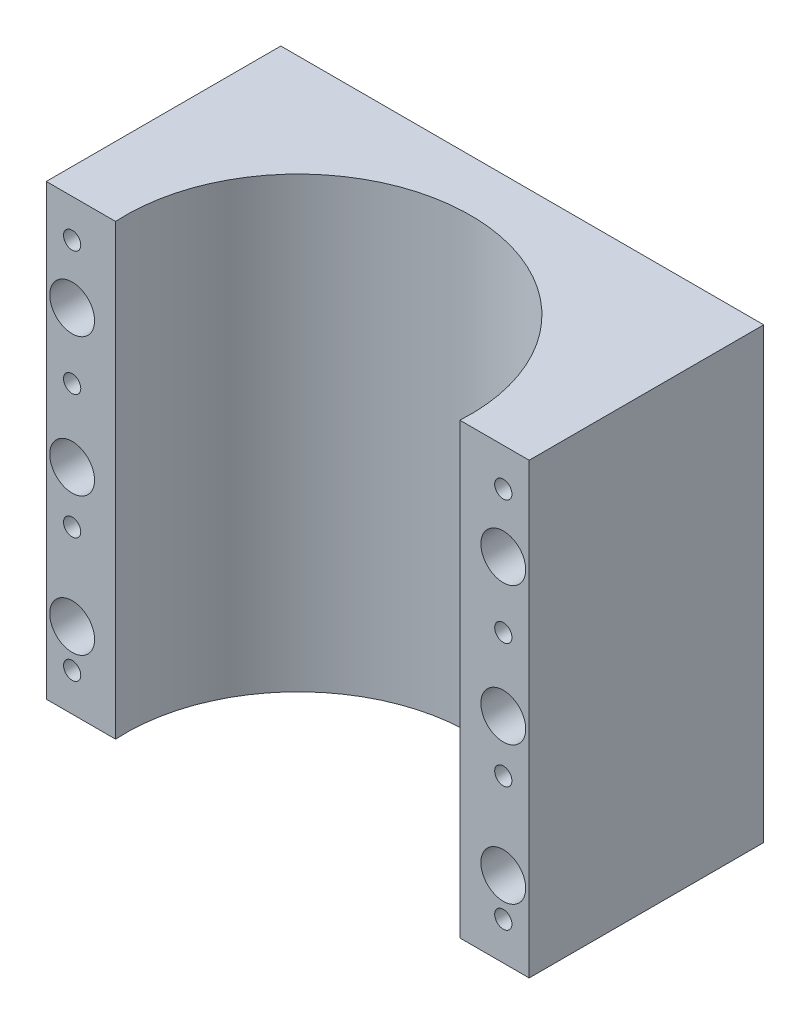
ISO-10303-21;
HEADER;
FILE_DESCRIPTION(('STEP AP214'),'2;1');
FILE_NAME('part.step','',(''),(''),'','','');
FILE_SCHEMA(('AUTOMOTIVE_DESIGN { 1 0 10303 214 1 1 1 1 }'));
ENDSEC;
DATA;
#1=APPLICATION_CONTEXT('core data for automotive mechanical design processes');
#2=APPLICATION_PROTOCOL_DEFINITION('international standard','automotive_design',2000,#1);
#3=PRODUCT_CONTEXT('',#1,'mechanical');
#4=PRODUCT('Part','Part','',(#3));
#5=PRODUCT_RELATED_PRODUCT_CATEGORY('part','',(#4));
#6=PRODUCT_DEFINITION_FORMATION('','',#4);
#7=PRODUCT_DEFINITION_CONTEXT('part definition',#1,'design');
#8=PRODUCT_DEFINITION('design','',#6,#7);
#9=PRODUCT_DEFINITION_SHAPE('','',#8);
#10=(LENGTH_UNIT() NAMED_UNIT(*) SI_UNIT(.MILLI.,.METRE.));
#11=(NAMED_UNIT(*) PLANE_ANGLE_UNIT() SI_UNIT($,.RADIAN.));
#12=(NAMED_UNIT(*) SI_UNIT($,.STERADIAN.) SOLID_ANGLE_UNIT());
#13=UNCERTAINTY_MEASURE_WITH_UNIT(LENGTH_MEASURE(1.E-05),#10,'distance_accuracy_value','');
#14=(GEOMETRIC_REPRESENTATION_CONTEXT(3) GLOBAL_UNCERTAINTY_ASSIGNED_CONTEXT((#13)) GLOBAL_UNIT_ASSIGNED_CONTEXT((#10,
#11,#12)) REPRESENTATION_CONTEXT('',''));
#15=CARTESIAN_POINT('',(0.,0.,0.));
#16=DIRECTION('',(0.,0.,1.));
#17=DIRECTION('',(1.,0.,0.));
#18=AXIS2_PLACEMENT_3D('',#15,#16,#17);
#19=CARTESIAN_POINT('',(0.,0.,68.));
#20=DIRECTION('',(0.,0.,1.));
#21=DIRECTION('',(1.,0.,0.));
#22=AXIS2_PLACEMENT_3D('',#19,#20,#21);
#23=PLANE('',#22);
#24=CARTESIAN_POINT('',(132.500000000001,-83.,68.));
#25=DIRECTION('',(0.,0.,1.));
#26=DIRECTION('',(1.,0.,0.));
#27=AXIS2_PLACEMENT_3D('',#24,#25,#26);
#28=CIRCLE('',#27,2.5);
#29=CARTESIAN_POINT('',(135.000000000001,-83.,68.));
#30=VERTEX_POINT('',#29);
#31=EDGE_CURVE('E151',#30,#30,#28,.T.);
#32=ORIENTED_EDGE('',*,*,#31,.F.);
#33=EDGE_LOOP('',(#32));
#34=FACE_BOUND('',#33,.T.);
#35=CARTESIAN_POINT('',(132.5,-47.,68.));
#36=DIRECTION('',(0.,0.,1.));
#37=DIRECTION('',(1.,0.,0.));
#38=AXIS2_PLACEMENT_3D('',#35,#36,#37);
#39=CIRCLE('',#38,2.5);
#40=CARTESIAN_POINT('',(135.,-47.,68.));
#41=VERTEX_POINT('',#40);
#42=EDGE_CURVE('E157',#41,#41,#39,.T.);
#43=ORIENTED_EDGE('',*,*,#42,.F.);
#44=EDGE_LOOP('',(#43));
#45=FACE_BOUND('',#44,.T.);
#46=CARTESIAN_POINT('',(132.5,-11.,68.));
#47=DIRECTION('',(0.,0.,1.));
#48=DIRECTION('',(1.,0.,0.));
#49=AXIS2_PLACEMENT_3D('',#46,#47,#48);
#50=CIRCLE('',#49,2.5);
#51=CARTESIAN_POINT('',(135.,-11.,68.));
#52=VERTEX_POINT('',#51);
#53=EDGE_CURVE('E163',#52,#52,#50,.T.);
#54=ORIENTED_EDGE('',*,*,#53,.F.);
#55=EDGE_LOOP('',(#54));
#56=FACE_BOUND('',#55,.T.);
#57=CARTESIAN_POINT('',(132.500000000001,-119.,68.));
#58=DIRECTION('',(0.,0.,1.));
#59=DIRECTION('',(1.,0.,0.));
#60=AXIS2_PLACEMENT_3D('',#57,#58,#59);
#61=CIRCLE('',#60,2.5);
#62=CARTESIAN_POINT('',(135.000000000001,-119.,68.));
#63=VERTEX_POINT('',#62);
#64=EDGE_CURVE('E175',#63,#63,#61,.T.);
#65=ORIENTED_EDGE('',*,*,#64,.F.);
#66=EDGE_LOOP('',(#65));
#67=FACE_BOUND('',#66,.T.);
#68=CARTESIAN_POINT('',(132.500000000001,-108.,68.));
#69=DIRECTION('',(0.,0.,1.));
#70=DIRECTION('',(1.,0.,0.));
#71=AXIS2_PLACEMENT_3D('',#68,#69,#70);
#72=CIRCLE('',#71,6.49999999999998);
#73=CARTESIAN_POINT('',(139.000000000001,-108.,68.));
#74=VERTEX_POINT('',#73);
#75=EDGE_CURVE('E228',#74,#74,#72,.T.);
#76=ORIENTED_EDGE('',*,*,#75,.F.);
#77=EDGE_LOOP('',(#76));
#78=FACE_BOUND('',#77,.T.);
#79=CARTESIAN_POINT('',(132.5,-68.,68.));
#80=DIRECTION('',(0.,0.,1.));
#81=DIRECTION('',(1.,0.,0.));
#82=AXIS2_PLACEMENT_3D('',#79,#80,#81);
#83=CIRCLE('',#82,6.49999999999998);
#84=CARTESIAN_POINT('',(139.,-68.,68.));
#85=VERTEX_POINT('',#84);
#86=EDGE_CURVE('E227',#85,#85,#83,.T.);
#87=ORIENTED_EDGE('',*,*,#86,.F.);
#88=EDGE_LOOP('',(#87));
#89=FACE_BOUND('',#88,.T.);
#90=CARTESIAN_POINT('',(132.5,-28.,68.));
#91=DIRECTION('',(0.,0.,1.));
#92=DIRECTION('',(1.,0.,0.));
#93=AXIS2_PLACEMENT_3D('',#90,#91,#92);
#94=CIRCLE('',#93,6.49999999999999);
#95=CARTESIAN_POINT('',(139.,-28.,68.));
#96=VERTEX_POINT('',#95);
#97=EDGE_CURVE('E240',#96,#96,#94,.T.);
#98=ORIENTED_EDGE('',*,*,#97,.F.);
#99=EDGE_LOOP('',(#98));
#100=FACE_BOUND('',#99,.T.);
#101=DIRECTION('',(0.,1.,0.));
#102=VECTOR('',#101,1.);
#103=CARTESIAN_POINT('',(119.909918853871,-130.,68.));
#104=LINE('',#103,#102);
#105=CARTESIAN_POINT('',(119.909918853871,-130.,68.));
#106=VERTEX_POINT('',#105);
#107=CARTESIAN_POINT('',(119.909918853871,0.,68.));
#108=VERTEX_POINT('',#107);
#109=EDGE_CURVE('E11',#106,#108,#104,.T.);
#110=ORIENTED_EDGE('',*,*,#109,.F.);
#111=DIRECTION('',(1.,0.,0.));
#112=VECTOR('',#111,1.);
#113=CARTESIAN_POINT('',(0.,-130.,68.));
#114=LINE('',#113,#112);
#115=CARTESIAN_POINT('',(140.,-130.,68.));
#116=VERTEX_POINT('',#115);
#117=EDGE_CURVE('E259',#106,#116,#114,.T.);
#118=ORIENTED_EDGE('',*,*,#117,.T.);
#119=DIRECTION('',(0.,1.,0.));
#120=VECTOR('',#119,1.);
#121=CARTESIAN_POINT('',(140.,0.,68.));
#122=LINE('',#121,#120);
#123=CARTESIAN_POINT('',(140.,0.,68.));
#124=VERTEX_POINT('',#123);
#125=EDGE_CURVE('E261',#116,#124,#122,.T.);
#126=ORIENTED_EDGE('',*,*,#125,.T.);
#127=DIRECTION('',(-1.,0.,0.));
#128=VECTOR('',#127,1.);
#129=CARTESIAN_POINT('',(0.,0.,68.));
#130=LINE('',#129,#128);
#131=EDGE_CURVE('E263',#124,#108,#130,.T.);
#132=ORIENTED_EDGE('',*,*,#131,.T.);
#133=EDGE_LOOP('',(#110,#118,#126,#132));
#134=FACE_BOUND('',#133,.T.);
#135=ADVANCED_FACE('F39',(#34,#45,#56,#67,#78,#89,#100,#134),#23,.T.);
#136=CARTESIAN_POINT('',(0.,0.,68.));
#137=DIRECTION('',(1.,0.,0.));
#138=DIRECTION('',(0.,1.,0.));
#139=AXIS2_PLACEMENT_3D('',#136,#137,#138);
#140=PLANE('',#139);
#141=DIRECTION('',(0.,-1.,0.));
#142=VECTOR('',#141,1.);
#143=CARTESIAN_POINT('',(0.,0.,0.));
#144=LINE('',#143,#142);
#145=CARTESIAN_POINT('',(0.,0.,0.));
#146=VERTEX_POINT('',#145);
#147=CARTESIAN_POINT('',(0.,-130.,0.));
#148=VERTEX_POINT('',#147);
#149=EDGE_CURVE('E255',#146,#148,#144,.T.);
#150=ORIENTED_EDGE('',*,*,#149,.T.);
#151=DIRECTION('',(0.,0.,-1.));
#152=VECTOR('',#151,1.);
#153=CARTESIAN_POINT('',(0.,-130.,68.));
#154=LINE('',#153,#152);
#155=CARTESIAN_POINT('',(0.,-130.,68.));
#156=VERTEX_POINT('',#155);
#157=EDGE_CURVE('E280',#156,#148,#154,.T.);
#158=ORIENTED_EDGE('',*,*,#157,.F.);
#159=DIRECTION('',(0.,-1.,0.));
#160=VECTOR('',#159,1.);
#161=CARTESIAN_POINT('',(0.,0.,68.));
#162=LINE('',#161,#160);
#163=CARTESIAN_POINT('',(0.,0.,68.));
#164=VERTEX_POINT('',#163);
#165=EDGE_CURVE('E257',#164,#156,#162,.T.);
#166=ORIENTED_EDGE('',*,*,#165,.F.);
#167=DIRECTION('',(0.,0.,-1.));
#168=VECTOR('',#167,1.);
#169=CARTESIAN_POINT('',(0.,0.,68.));
#170=LINE('',#169,#168);
#171=EDGE_CURVE('E266',#164,#146,#170,.T.);
#172=ORIENTED_EDGE('',*,*,#171,.T.);
#173=EDGE_LOOP('',(#150,#158,#166,#172));
#174=FACE_BOUND('',#173,.T.);
#175=ADVANCED_FACE('F41',(#174),#140,.F.);
#176=CARTESIAN_POINT('',(0.,-130.,68.));
#177=DIRECTION('',(0.,1.,0.));
#178=DIRECTION('',(0.,0.,1.));
#179=AXIS2_PLACEMENT_3D('',#176,#177,#178);
#180=PLANE('',#179);
#181=ORIENTED_EDGE('',*,*,#117,.F.);
#182=CARTESIAN_POINT('',(70.,-130.,65.));
#183=DIRECTION('',(0.,1.,0.));
#184=DIRECTION('',(0.,0.,1.));
#185=AXIS2_PLACEMENT_3D('',#182,#183,#184);
#186=CIRCLE('',#185,50.);
#187=CARTESIAN_POINT('',(20.0900811461289,-130.,68.));
#188=VERTEX_POINT('',#187);
#189=EDGE_CURVE('E253',#106,#188,#186,.T.);
#190=ORIENTED_EDGE('',*,*,#189,.T.);
#191=EDGE_CURVE('E91',#156,#188,#114,.T.);
#192=ORIENTED_EDGE('',*,*,#191,.F.);
#193=ORIENTED_EDGE('',*,*,#157,.T.);
#194=DIRECTION('',(1.,0.,0.));
#195=VECTOR('',#194,1.);
#196=CARTESIAN_POINT('',(0.,-130.,0.));
#197=LINE('',#196,#195);
#198=CARTESIAN_POINT('',(140.,-130.,0.));
#199=VERTEX_POINT('',#198);
#200=EDGE_CURVE('E269',#148,#199,#197,.T.);
#201=ORIENTED_EDGE('',*,*,#200,.T.);
#202=DIRECTION('',(0.,0.,-1.));
#203=VECTOR('',#202,1.);
#204=CARTESIAN_POINT('',(140.,-130.,68.));
#205=LINE('',#204,#203);
#206=EDGE_CURVE('E277',#116,#199,#205,.T.);
#207=ORIENTED_EDGE('',*,*,#206,.F.);
#208=EDGE_LOOP('',(#181,#190,#192,#193,#201,#207));
#209=FACE_BOUND('',#208,.T.);
#210=ADVANCED_FACE('F284',(#209),#180,.F.);
#211=CARTESIAN_POINT('',(140.,0.,68.));
#212=DIRECTION('',(-1.,0.,0.));
#213=DIRECTION('',(0.,-1.,0.));
#214=AXIS2_PLACEMENT_3D('',#211,#212,#213);
#215=PLANE('',#214);
#216=DIRECTION('',(0.,1.,0.));
#217=VECTOR('',#216,1.);
#218=CARTESIAN_POINT('',(140.,0.,0.));
#219=LINE('',#218,#217);
#220=CARTESIAN_POINT('',(140.,0.,0.));
#221=VERTEX_POINT('',#220);
#222=EDGE_CURVE('E271',#199,#221,#219,.T.);
#223=ORIENTED_EDGE('',*,*,#222,.T.);
#224=DIRECTION('',(0.,0.,-1.));
#225=VECTOR('',#224,1.);
#226=CARTESIAN_POINT('',(140.,0.,68.));
#227=LINE('',#226,#225);
#228=EDGE_CURVE('E275',#124,#221,#227,.T.);
#229=ORIENTED_EDGE('',*,*,#228,.F.);
#230=ORIENTED_EDGE('',*,*,#125,.F.);
#231=ORIENTED_EDGE('',*,*,#206,.T.);
#232=EDGE_LOOP('',(#223,#229,#230,#231));
#233=FACE_BOUND('',#232,.T.);
#234=ADVANCED_FACE('F295',(#233),#215,.F.);
#235=CARTESIAN_POINT('',(0.,0.,68.));
#236=DIRECTION('',(0.,-1.,0.));
#237=DIRECTION('',(0.,0.,-1.));
#238=AXIS2_PLACEMENT_3D('',#235,#236,#237);
#239=PLANE('',#238);
#240=CARTESIAN_POINT('',(20.0900811461289,0.,68.));
#241=VERTEX_POINT('',#240);
#242=EDGE_CURVE('E61',#241,#164,#130,.T.);
#243=ORIENTED_EDGE('',*,*,#242,.F.);
#244=CARTESIAN_POINT('',(70.,0.,65.));
#245=DIRECTION('',(0.,1.,0.));
#246=DIRECTION('',(0.,0.,1.));
#247=AXIS2_PLACEMENT_3D('',#244,#245,#246);
#248=CIRCLE('',#247,50.);
#249=EDGE_CURVE('E53',#108,#241,#248,.T.);
#250=ORIENTED_EDGE('',*,*,#249,.F.);
#251=ORIENTED_EDGE('',*,*,#131,.F.);
#252=ORIENTED_EDGE('',*,*,#228,.T.);
#253=DIRECTION('',(-1.,0.,0.));
#254=VECTOR('',#253,1.);
#255=CARTESIAN_POINT('',(0.,0.,0.));
#256=LINE('',#255,#254);
#257=EDGE_CURVE('E83',#221,#146,#256,.T.);
#258=ORIENTED_EDGE('',*,*,#257,.T.);
#259=ORIENTED_EDGE('',*,*,#171,.F.);
#260=EDGE_LOOP('',(#243,#250,#251,#252,#258,#259));
#261=FACE_BOUND('',#260,.T.);
#262=ADVANCED_FACE('F307',(#261),#239,.F.);
#263=CARTESIAN_POINT('',(7.50000000000002,-11.,68.));
#264=DIRECTION('',(0.,0.,1.));
#265=DIRECTION('',(1.,0.,0.));
#266=AXIS2_PLACEMENT_3D('',#263,#264,#265);
#267=CIRCLE('',#266,2.49999999999999);
#268=CARTESIAN_POINT('',(10.,-11.,68.));
#269=VERTEX_POINT('',#268);
#270=EDGE_CURVE('E135',#269,#269,#267,.T.);
#271=ORIENTED_EDGE('',*,*,#270,.F.);
#272=EDGE_LOOP('',(#271));
#273=FACE_BOUND('',#272,.T.);
#274=CARTESIAN_POINT('',(7.50000000000039,-47.,68.));
#275=DIRECTION('',(0.,0.,1.));
#276=DIRECTION('',(1.,0.,0.));
#277=AXIS2_PLACEMENT_3D('',#274,#275,#276);
#278=CIRCLE('',#277,2.49999999999999);
#279=CARTESIAN_POINT('',(10.0000000000004,-47.,68.));
#280=VERTEX_POINT('',#279);
#281=EDGE_CURVE('E134',#280,#280,#278,.T.);
#282=ORIENTED_EDGE('',*,*,#281,.F.);
#283=EDGE_LOOP('',(#282));
#284=FACE_BOUND('',#283,.T.);
#285=CARTESIAN_POINT('',(7.50000000000076,-83.,68.));
#286=DIRECTION('',(0.,0.,1.));
#287=DIRECTION('',(1.,0.,0.));
#288=AXIS2_PLACEMENT_3D('',#285,#286,#287);
#289=CIRCLE('',#288,2.49999999999999);
#290=CARTESIAN_POINT('',(10.0000000000008,-83.,68.));
#291=VERTEX_POINT('',#290);
#292=EDGE_CURVE('E145',#291,#291,#289,.T.);
#293=ORIENTED_EDGE('',*,*,#292,.F.);
#294=EDGE_LOOP('',(#293));
#295=FACE_BOUND('',#294,.T.);
#296=CARTESIAN_POINT('',(7.50000000000114,-119.,68.));
#297=DIRECTION('',(0.,0.,1.));
#298=DIRECTION('',(1.,0.,0.));
#299=AXIS2_PLACEMENT_3D('',#296,#297,#298);
#300=CIRCLE('',#299,2.49999999999999);
#301=CARTESIAN_POINT('',(10.0000000000011,-119.,68.));
#302=VERTEX_POINT('',#301);
#303=EDGE_CURVE('E169',#302,#302,#300,.T.);
#304=ORIENTED_EDGE('',*,*,#303,.F.);
#305=EDGE_LOOP('',(#304));
#306=FACE_BOUND('',#305,.T.);
#307=CARTESIAN_POINT('',(7.50000000000042,-68.,68.));
#308=DIRECTION('',(0.,0.,1.));
#309=DIRECTION('',(1.,0.,0.));
#310=AXIS2_PLACEMENT_3D('',#307,#308,#309);
#311=CIRCLE('',#310,6.5);
#312=CARTESIAN_POINT('',(14.0000000000004,-68.,68.));
#313=VERTEX_POINT('',#312);
#314=EDGE_CURVE('E221',#313,#313,#311,.T.);
#315=ORIENTED_EDGE('',*,*,#314,.F.);
#316=EDGE_LOOP('',(#315));
#317=FACE_BOUND('',#316,.T.);
#318=CARTESIAN_POINT('',(7.50000000000083,-108.,68.));
#319=DIRECTION('',(0.,0.,1.));
#320=DIRECTION('',(1.,0.,0.));
#321=AXIS2_PLACEMENT_3D('',#318,#319,#320);
#322=CIRCLE('',#321,6.5);
#323=CARTESIAN_POINT('',(14.0000000000008,-108.,68.));
#324=VERTEX_POINT('',#323);
#325=EDGE_CURVE('E215',#324,#324,#322,.T.);
#326=ORIENTED_EDGE('',*,*,#325,.F.);
#327=EDGE_LOOP('',(#326));
#328=FACE_BOUND('',#327,.T.);
#329=CARTESIAN_POINT('',(7.5,-28.,68.));
#330=DIRECTION('',(0.,0.,1.));
#331=DIRECTION('',(1.,0.,0.));
#332=AXIS2_PLACEMENT_3D('',#329,#330,#331);
#333=CIRCLE('',#332,6.5);
#334=CARTESIAN_POINT('',(14.,-28.,68.));
#335=VERTEX_POINT('',#334);
#336=EDGE_CURVE('E239',#335,#335,#333,.T.);
#337=ORIENTED_EDGE('',*,*,#336,.F.);
#338=EDGE_LOOP('',(#337));
#339=FACE_BOUND('',#338,.T.);
#340=DIRECTION('',(0.,1.,0.));
#341=VECTOR('',#340,1.);
#342=CARTESIAN_POINT('',(20.0900811461289,-130.,68.));
#343=LINE('',#342,#341);
#344=EDGE_CURVE('E47',#241,#188,#343,.F.);
#345=ORIENTED_EDGE('',*,*,#344,.F.);
#346=ORIENTED_EDGE('',*,*,#242,.T.);
#347=ORIENTED_EDGE('',*,*,#165,.T.);
#348=ORIENTED_EDGE('',*,*,#191,.T.);
#349=EDGE_LOOP('',(#345,#346,#347,#348));
#350=FACE_BOUND('',#349,.T.);
#351=ADVANCED_FACE('F286',(#273,#284,#295,#306,#317,#328,#339,#350),#23,.T.);
#352=CARTESIAN_POINT('',(0.,0.,0.));
#353=DIRECTION('',(0.,0.,1.));
#354=DIRECTION('',(1.,0.,0.));
#355=AXIS2_PLACEMENT_3D('',#352,#353,#354);
#356=PLANE('',#355);
#357=CARTESIAN_POINT('',(7.50000000000042,-68.,0.));
#358=DIRECTION('',(0.,0.,1.));
#359=DIRECTION('',(1.,0.,0.));
#360=AXIS2_PLACEMENT_3D('',#357,#358,#359);
#361=CIRCLE('',#360,4.);
#362=CARTESIAN_POINT('',(11.5000000000004,-68.,0.));
#363=VERTEX_POINT('',#362);
#364=EDGE_CURVE('E195',#363,#363,#361,.T.);
#365=ORIENTED_EDGE('',*,*,#364,.T.);
#366=EDGE_LOOP('',(#365));
#367=FACE_BOUND('',#366,.T.);
#368=CARTESIAN_POINT('',(132.500000000001,-108.,0.));
#369=DIRECTION('',(0.,0.,1.));
#370=DIRECTION('',(1.,0.,0.));
#371=AXIS2_PLACEMENT_3D('',#368,#369,#370);
#372=CIRCLE('',#371,3.99999999999999);
#373=CARTESIAN_POINT('',(136.500000000001,-108.,0.));
#374=VERTEX_POINT('',#373);
#375=EDGE_CURVE('E188',#374,#374,#372,.T.);
#376=ORIENTED_EDGE('',*,*,#375,.T.);
#377=EDGE_LOOP('',(#376));
#378=FACE_BOUND('',#377,.T.);
#379=CARTESIAN_POINT('',(132.5,-68.,0.));
#380=DIRECTION('',(0.,0.,1.));
#381=DIRECTION('',(1.,0.,0.));
#382=AXIS2_PLACEMENT_3D('',#379,#380,#381);
#383=CIRCLE('',#382,3.99999999999999);
#384=CARTESIAN_POINT('',(136.5,-68.,0.));
#385=VERTEX_POINT('',#384);
#386=EDGE_CURVE('E207',#385,#385,#383,.T.);
#387=ORIENTED_EDGE('',*,*,#386,.T.);
#388=EDGE_LOOP('',(#387));
#389=FACE_BOUND('',#388,.T.);
#390=CARTESIAN_POINT('',(7.5,-28.,0.));
#391=DIRECTION('',(0.,0.,1.));
#392=DIRECTION('',(1.,0.,0.));
#393=AXIS2_PLACEMENT_3D('',#390,#391,#392);
#394=CIRCLE('',#393,4.);
#395=CARTESIAN_POINT('',(11.5,-28.,0.));
#396=VERTEX_POINT('',#395);
#397=EDGE_CURVE('E200',#396,#396,#394,.T.);
#398=ORIENTED_EDGE('',*,*,#397,.T.);
#399=EDGE_LOOP('',(#398));
#400=FACE_BOUND('',#399,.T.);
#401=CARTESIAN_POINT('',(7.50000000000083,-108.,0.));
#402=DIRECTION('',(0.,0.,1.));
#403=DIRECTION('',(1.,0.,0.));
#404=AXIS2_PLACEMENT_3D('',#401,#402,#403);
#405=CIRCLE('',#404,4.);
#406=CARTESIAN_POINT('',(11.5000000000008,-108.,0.));
#407=VERTEX_POINT('',#406);
#408=EDGE_CURVE('E182',#407,#407,#405,.T.);
#409=ORIENTED_EDGE('',*,*,#408,.T.);
#410=EDGE_LOOP('',(#409));
#411=FACE_BOUND('',#410,.T.);
#412=CARTESIAN_POINT('',(132.5,-28.,0.));
#413=DIRECTION('',(0.,0.,1.));
#414=DIRECTION('',(1.,0.,0.));
#415=AXIS2_PLACEMENT_3D('',#412,#413,#414);
#416=CIRCLE('',#415,3.99999999999999);
#417=CARTESIAN_POINT('',(136.5,-28.,0.));
#418=VERTEX_POINT('',#417);
#419=EDGE_CURVE('E212',#418,#418,#416,.T.);
#420=ORIENTED_EDGE('',*,*,#419,.T.);
#421=EDGE_LOOP('',(#420));
#422=FACE_BOUND('',#421,.T.);
#423=ORIENTED_EDGE('',*,*,#149,.F.);
#424=ORIENTED_EDGE('',*,*,#257,.F.);
#425=ORIENTED_EDGE('',*,*,#222,.F.);
#426=ORIENTED_EDGE('',*,*,#200,.F.);
#427=EDGE_LOOP('',(#423,#424,#425,#426));
#428=FACE_BOUND('',#427,.T.);
#429=ADVANCED_FACE('F297',(#367,#378,#389,#400,#411,#422,#428),#356,.F.);
#430=CARTESIAN_POINT('',(70.,-130.,65.));
#431=DIRECTION('',(0.,1.,0.));
#432=DIRECTION('',(0.,0.,1.));
#433=AXIS2_PLACEMENT_3D('',#430,#431,#432);
#434=CYLINDRICAL_SURFACE('',#433,50.);
#435=ORIENTED_EDGE('',*,*,#109,.T.);
#436=ORIENTED_EDGE('',*,*,#249,.T.);
#437=ORIENTED_EDGE('',*,*,#344,.T.);
#438=ORIENTED_EDGE('',*,*,#189,.F.);
#439=EDGE_LOOP('',(#435,#436,#437,#438));
#440=FACE_BOUND('',#439,.T.);
#441=ADVANCED_FACE('F281',(#440),#434,.F.);
#442=CARTESIAN_POINT('',(7.5,-28.,33.));
#443=DIRECTION('',(0.,0.,1.));
#444=DIRECTION('',(1.,0.,0.));
#445=AXIS2_PLACEMENT_3D('',#442,#443,#444);
#446=CYLINDRICAL_SURFACE('',#445,6.5);
#447=CARTESIAN_POINT('',(7.5,-28.,33.));
#448=DIRECTION('',(0.,0.,1.));
#449=DIRECTION('',(1.,0.,0.));
#450=AXIS2_PLACEMENT_3D('',#447,#448,#449);
#451=CIRCLE('',#450,6.5);
#452=CARTESIAN_POINT('',(14.,-28.,33.));
#453=VERTEX_POINT('',#452);
#454=EDGE_CURVE('E248',#453,#453,#451,.T.);
#455=ORIENTED_EDGE('',*,*,#454,.F.);
#456=EDGE_LOOP('',(#455));
#457=FACE_BOUND('',#456,.T.);
#458=ORIENTED_EDGE('',*,*,#336,.T.);
#459=EDGE_LOOP('',(#458));
#460=FACE_BOUND('',#459,.T.);
#461=ADVANCED_FACE('F305',(#457,#460),#446,.F.);
#462=CARTESIAN_POINT('',(7.5,-28.,33.));
#463=DIRECTION('',(0.,0.,1.));
#464=DIRECTION('',(1.,0.,0.));
#465=AXIS2_PLACEMENT_3D('',#462,#463,#464);
#466=PLANE('',#465);
#467=CARTESIAN_POINT('',(7.5,-28.,33.));
#468=DIRECTION('',(0.,0.,1.));
#469=DIRECTION('',(1.,0.,0.));
#470=AXIS2_PLACEMENT_3D('',#467,#468,#469);
#471=CIRCLE('',#470,4.);
#472=CARTESIAN_POINT('',(11.5,-28.,33.));
#473=VERTEX_POINT('',#472);
#474=EDGE_CURVE('E204',#473,#473,#471,.T.);
#475=ORIENTED_EDGE('',*,*,#474,.F.);
#476=EDGE_LOOP('',(#475));
#477=FACE_BOUND('',#476,.T.);
#478=ORIENTED_EDGE('',*,*,#454,.T.);
#479=EDGE_LOOP('',(#478));
#480=FACE_BOUND('',#479,.T.);
#481=ADVANCED_FACE('F322',(#477,#480),#466,.T.);
#482=CARTESIAN_POINT('',(7.50000000000083,-108.,33.));
#483=DIRECTION('',(0.,0.,1.));
#484=DIRECTION('',(1.,0.,0.));
#485=AXIS2_PLACEMENT_3D('',#482,#483,#484);
#486=CYLINDRICAL_SURFACE('',#485,6.5);
#487=CARTESIAN_POINT('',(7.50000000000083,-108.,33.));
#488=DIRECTION('',(0.,0.,1.));
#489=DIRECTION('',(1.,0.,0.));
#490=AXIS2_PLACEMENT_3D('',#487,#488,#489);
#491=CIRCLE('',#490,6.5);
#492=CARTESIAN_POINT('',(14.0000000000008,-108.,33.));
#493=VERTEX_POINT('',#492);
#494=EDGE_CURVE('E218',#493,#493,#491,.T.);
#495=ORIENTED_EDGE('',*,*,#494,.F.);
#496=EDGE_LOOP('',(#495));
#497=FACE_BOUND('',#496,.T.);
#498=ORIENTED_EDGE('',*,*,#325,.T.);
#499=EDGE_LOOP('',(#498));
#500=FACE_BOUND('',#499,.T.);
#501=ADVANCED_FACE('F326',(#497,#500),#486,.F.);
#502=CARTESIAN_POINT('',(7.50000000000083,-108.,33.));
#503=DIRECTION('',(0.,0.,1.));
#504=DIRECTION('',(1.,0.,0.));
#505=AXIS2_PLACEMENT_3D('',#502,#503,#504);
#506=PLANE('',#505);
#507=CARTESIAN_POINT('',(7.50000000000083,-108.,33.));
#508=DIRECTION('',(0.,0.,1.));
#509=DIRECTION('',(1.,0.,0.));
#510=AXIS2_PLACEMENT_3D('',#507,#508,#509);
#511=CIRCLE('',#510,4.);
#512=CARTESIAN_POINT('',(11.5000000000008,-108.,33.));
#513=VERTEX_POINT('',#512);
#514=EDGE_CURVE('E181',#513,#513,#511,.T.);
#515=ORIENTED_EDGE('',*,*,#514,.F.);
#516=EDGE_LOOP('',(#515));
#517=FACE_BOUND('',#516,.T.);
#518=ORIENTED_EDGE('',*,*,#494,.T.);
#519=EDGE_LOOP('',(#518));
#520=FACE_BOUND('',#519,.T.);
#521=ADVANCED_FACE('F349',(#517,#520),#506,.T.);
#522=CARTESIAN_POINT('',(7.50000000000042,-68.,33.));
#523=DIRECTION('',(0.,0.,1.));
#524=DIRECTION('',(1.,0.,0.));
#525=AXIS2_PLACEMENT_3D('',#522,#523,#524);
#526=CYLINDRICAL_SURFACE('',#525,6.5);
#527=CARTESIAN_POINT('',(7.50000000000042,-68.,33.));
#528=DIRECTION('',(0.,0.,1.));
#529=DIRECTION('',(1.,0.,0.));
#530=AXIS2_PLACEMENT_3D('',#527,#528,#529);
#531=CIRCLE('',#530,6.5);
#532=CARTESIAN_POINT('',(14.0000000000004,-68.,33.));
#533=VERTEX_POINT('',#532);
#534=EDGE_CURVE('E231',#533,#533,#531,.T.);
#535=ORIENTED_EDGE('',*,*,#534,.F.);
#536=EDGE_LOOP('',(#535));
#537=FACE_BOUND('',#536,.T.);
#538=ORIENTED_EDGE('',*,*,#314,.T.);
#539=EDGE_LOOP('',(#538));
#540=FACE_BOUND('',#539,.T.);
#541=ADVANCED_FACE('F346',(#537,#540),#526,.F.);
#542=CARTESIAN_POINT('',(7.50000000000042,-68.,33.));
#543=DIRECTION('',(0.,0.,1.));
#544=DIRECTION('',(1.,0.,0.));
#545=AXIS2_PLACEMENT_3D('',#542,#543,#544);
#546=PLANE('',#545);
#547=CARTESIAN_POINT('',(7.50000000000042,-68.,33.));
#548=DIRECTION('',(0.,0.,1.));
#549=DIRECTION('',(1.,0.,0.));
#550=AXIS2_PLACEMENT_3D('',#547,#548,#549);
#551=CIRCLE('',#550,4.);
#552=CARTESIAN_POINT('',(11.5000000000004,-68.,33.));
#553=VERTEX_POINT('',#552);
#554=EDGE_CURVE('E185',#553,#553,#551,.T.);
#555=ORIENTED_EDGE('',*,*,#554,.F.);
#556=EDGE_LOOP('',(#555));
#557=FACE_BOUND('',#556,.T.);
#558=ORIENTED_EDGE('',*,*,#534,.T.);
#559=EDGE_LOOP('',(#558));
#560=FACE_BOUND('',#559,.T.);
#561=ADVANCED_FACE('F341',(#557,#560),#546,.T.);
#562=CARTESIAN_POINT('',(132.5,-28.,33.));
#563=DIRECTION('',(0.,0.,1.));
#564=DIRECTION('',(1.,0.,0.));
#565=AXIS2_PLACEMENT_3D('',#562,#563,#564);
#566=CYLINDRICAL_SURFACE('',#565,6.49999999999999);
#567=CARTESIAN_POINT('',(132.5,-28.,33.));
#568=DIRECTION('',(0.,0.,1.));
#569=DIRECTION('',(1.,0.,0.));
#570=AXIS2_PLACEMENT_3D('',#567,#568,#569);
#571=CIRCLE('',#570,6.49999999999999);
#572=CARTESIAN_POINT('',(139.,-28.,33.));
#573=VERTEX_POINT('',#572);
#574=EDGE_CURVE('E236',#573,#573,#571,.T.);
#575=ORIENTED_EDGE('',*,*,#574,.F.);
#576=EDGE_LOOP('',(#575));
#577=FACE_BOUND('',#576,.T.);
#578=ORIENTED_EDGE('',*,*,#97,.T.);
#579=EDGE_LOOP('',(#578));
#580=FACE_BOUND('',#579,.T.);
#581=ADVANCED_FACE('F338',(#577,#580),#566,.F.);
#582=CARTESIAN_POINT('',(132.5,-28.,33.));
#583=DIRECTION('',(0.,0.,1.));
#584=DIRECTION('',(1.,0.,0.));
#585=AXIS2_PLACEMENT_3D('',#582,#583,#584);
#586=PLANE('',#585);
#587=CARTESIAN_POINT('',(132.5,-28.,33.));
#588=DIRECTION('',(0.,0.,1.));
#589=DIRECTION('',(1.,0.,0.));
#590=AXIS2_PLACEMENT_3D('',#587,#588,#589);
#591=CIRCLE('',#590,3.99999999999999);
#592=CARTESIAN_POINT('',(136.5,-28.,33.));
#593=VERTEX_POINT('',#592);
#594=EDGE_CURVE('E203',#593,#593,#591,.T.);
#595=ORIENTED_EDGE('',*,*,#594,.F.);
#596=EDGE_LOOP('',(#595));
#597=FACE_BOUND('',#596,.T.);
#598=ORIENTED_EDGE('',*,*,#574,.T.);
#599=EDGE_LOOP('',(#598));
#600=FACE_BOUND('',#599,.T.);
#601=ADVANCED_FACE('F332',(#597,#600),#586,.T.);
#602=CARTESIAN_POINT('',(132.5,-68.,33.));
#603=DIRECTION('',(0.,0.,1.));
#604=DIRECTION('',(1.,0.,0.));
#605=AXIS2_PLACEMENT_3D('',#602,#603,#604);
#606=CYLINDRICAL_SURFACE('',#605,6.49999999999998);
#607=CARTESIAN_POINT('',(132.5,-68.,33.));
#608=DIRECTION('',(0.,0.,1.));
#609=DIRECTION('',(1.,0.,0.));
#610=AXIS2_PLACEMENT_3D('',#607,#608,#609);
#611=CIRCLE('',#610,6.49999999999998);
#612=CARTESIAN_POINT('',(139.,-68.,33.));
#613=VERTEX_POINT('',#612);
#614=EDGE_CURVE('E243',#613,#613,#611,.T.);
#615=ORIENTED_EDGE('',*,*,#614,.F.);
#616=EDGE_LOOP('',(#615));
#617=FACE_BOUND('',#616,.T.);
#618=ORIENTED_EDGE('',*,*,#86,.T.);
#619=EDGE_LOOP('',(#618));
#620=FACE_BOUND('',#619,.T.);
#621=ADVANCED_FACE('F328',(#617,#620),#606,.F.);
#622=CARTESIAN_POINT('',(132.5,-68.,33.));
#623=DIRECTION('',(0.,0.,1.));
#624=DIRECTION('',(1.,0.,0.));
#625=AXIS2_PLACEMENT_3D('',#622,#623,#624);
#626=PLANE('',#625);
#627=CARTESIAN_POINT('',(132.5,-68.,33.));
#628=DIRECTION('',(0.,0.,1.));
#629=DIRECTION('',(1.,0.,0.));
#630=AXIS2_PLACEMENT_3D('',#627,#628,#629);
#631=CIRCLE('',#630,3.99999999999999);
#632=CARTESIAN_POINT('',(136.5,-68.,33.));
#633=VERTEX_POINT('',#632);
#634=EDGE_CURVE('E191',#633,#633,#631,.T.);
#635=ORIENTED_EDGE('',*,*,#634,.F.);
#636=EDGE_LOOP('',(#635));
#637=FACE_BOUND('',#636,.T.);
#638=ORIENTED_EDGE('',*,*,#614,.T.);
#639=EDGE_LOOP('',(#638));
#640=FACE_BOUND('',#639,.T.);
#641=ADVANCED_FACE('F331',(#637,#640),#626,.T.);
#642=CARTESIAN_POINT('',(132.500000000001,-108.,33.));
#643=DIRECTION('',(0.,0.,1.));
#644=DIRECTION('',(1.,0.,0.));
#645=AXIS2_PLACEMENT_3D('',#642,#643,#644);
#646=CYLINDRICAL_SURFACE('',#645,6.49999999999998);
#647=CARTESIAN_POINT('',(132.500000000001,-108.,33.));
#648=DIRECTION('',(0.,0.,1.));
#649=DIRECTION('',(1.,0.,0.));
#650=AXIS2_PLACEMENT_3D('',#647,#648,#649);
#651=CIRCLE('',#650,6.49999999999998);
#652=CARTESIAN_POINT('',(139.000000000001,-108.,33.));
#653=VERTEX_POINT('',#652);
#654=EDGE_CURVE('E224',#653,#653,#651,.T.);
#655=ORIENTED_EDGE('',*,*,#654,.F.);
#656=EDGE_LOOP('',(#655));
#657=FACE_BOUND('',#656,.T.);
#658=ORIENTED_EDGE('',*,*,#75,.T.);
#659=EDGE_LOOP('',(#658));
#660=FACE_BOUND('',#659,.T.);
#661=ADVANCED_FACE('F336',(#657,#660),#646,.F.);
#662=CARTESIAN_POINT('',(132.500000000001,-108.,33.));
#663=DIRECTION('',(0.,0.,1.));
#664=DIRECTION('',(1.,0.,0.));
#665=AXIS2_PLACEMENT_3D('',#662,#663,#664);
#666=PLANE('',#665);
#667=CARTESIAN_POINT('',(132.500000000001,-108.,33.));
#668=DIRECTION('',(0.,0.,1.));
#669=DIRECTION('',(1.,0.,0.));
#670=AXIS2_PLACEMENT_3D('',#667,#668,#669);
#671=CIRCLE('',#670,3.99999999999999);
#672=CARTESIAN_POINT('',(136.500000000001,-108.,33.));
#673=VERTEX_POINT('',#672);
#674=EDGE_CURVE('E192',#673,#673,#671,.T.);
#675=ORIENTED_EDGE('',*,*,#674,.F.);
#676=EDGE_LOOP('',(#675));
#677=FACE_BOUND('',#676,.T.);
#678=ORIENTED_EDGE('',*,*,#654,.T.);
#679=EDGE_LOOP('',(#678));
#680=FACE_BOUND('',#679,.T.);
#681=ADVANCED_FACE('F356',(#677,#680),#666,.T.);
#682=CARTESIAN_POINT('',(132.5,-28.,0.));
#683=DIRECTION('',(0.,0.,1.));
#684=DIRECTION('',(1.,0.,0.));
#685=AXIS2_PLACEMENT_3D('',#682,#683,#684);
#686=CYLINDRICAL_SURFACE('',#685,3.99999999999999);
#687=ORIENTED_EDGE('',*,*,#419,.F.);
#688=EDGE_LOOP('',(#687));
#689=FACE_BOUND('',#688,.T.);
#690=ORIENTED_EDGE('',*,*,#594,.T.);
#691=EDGE_LOOP('',(#690));
#692=FACE_BOUND('',#691,.T.);
#693=ADVANCED_FACE('F360',(#689,#692),#686,.F.);
#694=CARTESIAN_POINT('',(7.50000000000083,-108.,0.));
#695=DIRECTION('',(0.,0.,1.));
#696=DIRECTION('',(1.,0.,0.));
#697=AXIS2_PLACEMENT_3D('',#694,#695,#696);
#698=CYLINDRICAL_SURFACE('',#697,4.);
#699=ORIENTED_EDGE('',*,*,#408,.F.);
#700=EDGE_LOOP('',(#699));
#701=FACE_BOUND('',#700,.T.);
#702=ORIENTED_EDGE('',*,*,#514,.T.);
#703=EDGE_LOOP('',(#702));
#704=FACE_BOUND('',#703,.T.);
#705=ADVANCED_FACE('F370',(#701,#704),#698,.F.);
#706=CARTESIAN_POINT('',(7.5,-28.,0.));
#707=DIRECTION('',(0.,0.,1.));
#708=DIRECTION('',(1.,0.,0.));
#709=AXIS2_PLACEMENT_3D('',#706,#707,#708);
#710=CYLINDRICAL_SURFACE('',#709,4.);
#711=ORIENTED_EDGE('',*,*,#397,.F.);
#712=EDGE_LOOP('',(#711));
#713=FACE_BOUND('',#712,.T.);
#714=ORIENTED_EDGE('',*,*,#474,.T.);
#715=EDGE_LOOP('',(#714));
#716=FACE_BOUND('',#715,.T.);
#717=ADVANCED_FACE('F376',(#713,#716),#710,.F.);
#718=CARTESIAN_POINT('',(132.5,-68.,0.));
#719=DIRECTION('',(0.,0.,1.));
#720=DIRECTION('',(1.,0.,0.));
#721=AXIS2_PLACEMENT_3D('',#718,#719,#720);
#722=CYLINDRICAL_SURFACE('',#721,3.99999999999999);
#723=ORIENTED_EDGE('',*,*,#386,.F.);
#724=EDGE_LOOP('',(#723));
#725=FACE_BOUND('',#724,.T.);
#726=ORIENTED_EDGE('',*,*,#634,.T.);
#727=EDGE_LOOP('',(#726));
#728=FACE_BOUND('',#727,.T.);
#729=ADVANCED_FACE('F372',(#725,#728),#722,.F.);
#730=CARTESIAN_POINT('',(132.500000000001,-108.,0.));
#731=DIRECTION('',(0.,0.,1.));
#732=DIRECTION('',(1.,0.,0.));
#733=AXIS2_PLACEMENT_3D('',#730,#731,#732);
#734=CYLINDRICAL_SURFACE('',#733,3.99999999999999);
#735=ORIENTED_EDGE('',*,*,#375,.F.);
#736=EDGE_LOOP('',(#735));
#737=FACE_BOUND('',#736,.T.);
#738=ORIENTED_EDGE('',*,*,#674,.T.);
#739=EDGE_LOOP('',(#738));
#740=FACE_BOUND('',#739,.T.);
#741=ADVANCED_FACE('F375',(#737,#740),#734,.F.);
#742=CARTESIAN_POINT('',(7.50000000000042,-68.,0.));
#743=DIRECTION('',(0.,0.,1.));
#744=DIRECTION('',(1.,0.,0.));
#745=AXIS2_PLACEMENT_3D('',#742,#743,#744);
#746=CYLINDRICAL_SURFACE('',#745,4.);
#747=ORIENTED_EDGE('',*,*,#364,.F.);
#748=EDGE_LOOP('',(#747));
#749=FACE_BOUND('',#748,.T.);
#750=ORIENTED_EDGE('',*,*,#554,.T.);
#751=EDGE_LOOP('',(#750));
#752=FACE_BOUND('',#751,.T.);
#753=ADVANCED_FACE('F381',(#749,#752),#746,.F.);
#754=CARTESIAN_POINT('',(132.500000000001,-119.,53.));
#755=DIRECTION('',(0.,0.,1.));
#756=DIRECTION('',(1.,0.,0.));
#757=AXIS2_PLACEMENT_3D('',#754,#755,#756);
#758=CONICAL_SURFACE('',#757,2.5,1.02974425867666);
#759=CARTESIAN_POINT('',(132.500000000001,-119.,51.4978484524311));
#760=VERTEX_POINT('',#759);
#761=VERTEX_LOOP('',#760);
#762=FACE_BOUND('',#761,.T.);
#763=CARTESIAN_POINT('',(132.500000000001,-119.,53.));
#764=DIRECTION('',(0.,0.,1.));
#765=DIRECTION('',(1.,0.,0.));
#766=AXIS2_PLACEMENT_3D('',#763,#764,#765);
#767=CIRCLE('',#766,2.5);
#768=CARTESIAN_POINT('',(135.000000000001,-119.,53.));
#769=VERTEX_POINT('',#768);
#770=EDGE_CURVE('E178',#769,#769,#767,.T.);
#771=ORIENTED_EDGE('',*,*,#770,.T.);
#772=EDGE_LOOP('',(#771));
#773=FACE_BOUND('',#772,.T.);
#774=ADVANCED_FACE('F384',(#762,#773),#758,.F.);
#775=CARTESIAN_POINT('',(132.500000000001,-119.,68.));
#776=DIRECTION('',(0.,0.,1.));
#777=DIRECTION('',(1.,0.,0.));
#778=AXIS2_PLACEMENT_3D('',#775,#776,#777);
#779=CYLINDRICAL_SURFACE('',#778,2.5);
#780=ORIENTED_EDGE('',*,*,#770,.F.);
#781=EDGE_LOOP('',(#780));
#782=FACE_BOUND('',#781,.T.);
#783=ORIENTED_EDGE('',*,*,#64,.T.);
#784=EDGE_LOOP('',(#783));
#785=FACE_BOUND('',#784,.T.);
#786=ADVANCED_FACE('F394',(#782,#785),#779,.F.);
#787=CARTESIAN_POINT('',(7.50000000000114,-119.,53.));
#788=DIRECTION('',(0.,0.,1.));
#789=DIRECTION('',(1.,0.,0.));
#790=AXIS2_PLACEMENT_3D('',#787,#788,#789);
#791=CONICAL_SURFACE('',#790,2.49999999999999,1.02974425867665);
#792=CARTESIAN_POINT('',(7.50000000000114,-119.,51.4978484524311));
#793=VERTEX_POINT('',#792);
#794=VERTEX_LOOP('',#793);
#795=FACE_BOUND('',#794,.T.);
#796=CARTESIAN_POINT('',(7.50000000000114,-119.,53.));
#797=DIRECTION('',(0.,0.,1.));
#798=DIRECTION('',(1.,0.,0.));
#799=AXIS2_PLACEMENT_3D('',#796,#797,#798);
#800=CIRCLE('',#799,2.49999999999999);
#801=CARTESIAN_POINT('',(10.0000000000011,-119.,53.));
#802=VERTEX_POINT('',#801);
#803=EDGE_CURVE('E172',#802,#802,#800,.T.);
#804=ORIENTED_EDGE('',*,*,#803,.T.);
#805=EDGE_LOOP('',(#804));
#806=FACE_BOUND('',#805,.T.);
#807=ADVANCED_FACE('F398',(#795,#806),#791,.F.);
#808=CARTESIAN_POINT('',(7.50000000000114,-119.,68.));
#809=DIRECTION('',(0.,0.,1.));
#810=DIRECTION('',(1.,0.,0.));
#811=AXIS2_PLACEMENT_3D('',#808,#809,#810);
#812=CYLINDRICAL_SURFACE('',#811,2.49999999999999);
#813=ORIENTED_EDGE('',*,*,#803,.F.);
#814=EDGE_LOOP('',(#813));
#815=FACE_BOUND('',#814,.T.);
#816=ORIENTED_EDGE('',*,*,#303,.T.);
#817=EDGE_LOOP('',(#816));
#818=FACE_BOUND('',#817,.T.);
#819=ADVANCED_FACE('F402',(#815,#818),#812,.F.);
#820=CARTESIAN_POINT('',(132.5,-11.,53.));
#821=DIRECTION('',(0.,0.,1.));
#822=DIRECTION('',(1.,0.,0.));
#823=AXIS2_PLACEMENT_3D('',#820,#821,#822);
#824=CONICAL_SURFACE('',#823,2.5,1.02974425867666);
#825=CARTESIAN_POINT('',(132.5,-11.,51.4978484524311));
#826=VERTEX_POINT('',#825);
#827=VERTEX_LOOP('',#826);
#828=FACE_BOUND('',#827,.T.);
#829=CARTESIAN_POINT('',(132.5,-11.,53.));
#830=DIRECTION('',(0.,0.,1.));
#831=DIRECTION('',(1.,0.,0.));
#832=AXIS2_PLACEMENT_3D('',#829,#830,#831);
#833=CIRCLE('',#832,2.5);
#834=CARTESIAN_POINT('',(135.,-11.,53.));
#835=VERTEX_POINT('',#834);
#836=EDGE_CURVE('E166',#835,#835,#833,.T.);
#837=ORIENTED_EDGE('',*,*,#836,.T.);
#838=EDGE_LOOP('',(#837));
#839=FACE_BOUND('',#838,.T.);
#840=ADVANCED_FACE('F406',(#828,#839),#824,.F.);
#841=CARTESIAN_POINT('',(132.5,-11.,68.));
#842=DIRECTION('',(0.,0.,1.));
#843=DIRECTION('',(1.,0.,0.));
#844=AXIS2_PLACEMENT_3D('',#841,#842,#843);
#845=CYLINDRICAL_SURFACE('',#844,2.5);
#846=ORIENTED_EDGE('',*,*,#836,.F.);
#847=EDGE_LOOP('',(#846));
#848=FACE_BOUND('',#847,.T.);
#849=ORIENTED_EDGE('',*,*,#53,.T.);
#850=EDGE_LOOP('',(#849));
#851=FACE_BOUND('',#850,.T.);
#852=ADVANCED_FACE('F410',(#848,#851),#845,.F.);
#853=CARTESIAN_POINT('',(132.5,-47.,53.));
#854=DIRECTION('',(0.,0.,1.));
#855=DIRECTION('',(1.,0.,0.));
#856=AXIS2_PLACEMENT_3D('',#853,#854,#855);
#857=CONICAL_SURFACE('',#856,2.5,1.02974425867666);
#858=CARTESIAN_POINT('',(132.5,-47.,51.4978484524311));
#859=VERTEX_POINT('',#858);
#860=VERTEX_LOOP('',#859);
#861=FACE_BOUND('',#860,.T.);
#862=CARTESIAN_POINT('',(132.5,-47.,53.));
#863=DIRECTION('',(0.,0.,1.));
#864=DIRECTION('',(1.,0.,0.));
#865=AXIS2_PLACEMENT_3D('',#862,#863,#864);
#866=CIRCLE('',#865,2.5);
#867=CARTESIAN_POINT('',(135.,-47.,53.));
#868=VERTEX_POINT('',#867);
#869=EDGE_CURVE('E160',#868,#868,#866,.T.);
#870=ORIENTED_EDGE('',*,*,#869,.T.);
#871=EDGE_LOOP('',(#870));
#872=FACE_BOUND('',#871,.T.);
#873=ADVANCED_FACE('F414',(#861,#872),#857,.F.);
#874=CARTESIAN_POINT('',(132.5,-47.,68.));
#875=DIRECTION('',(0.,0.,1.));
#876=DIRECTION('',(1.,0.,0.));
#877=AXIS2_PLACEMENT_3D('',#874,#875,#876);
#878=CYLINDRICAL_SURFACE('',#877,2.5);
#879=ORIENTED_EDGE('',*,*,#869,.F.);
#880=EDGE_LOOP('',(#879));
#881=FACE_BOUND('',#880,.T.);
#882=ORIENTED_EDGE('',*,*,#42,.T.);
#883=EDGE_LOOP('',(#882));
#884=FACE_BOUND('',#883,.T.);
#885=ADVANCED_FACE('F418',(#881,#884),#878,.F.);
#886=CARTESIAN_POINT('',(132.500000000001,-83.,53.));
#887=DIRECTION('',(0.,0.,1.));
#888=DIRECTION('',(1.,0.,0.));
#889=AXIS2_PLACEMENT_3D('',#886,#887,#888);
#890=CONICAL_SURFACE('',#889,2.49999999999997,1.02974425867665);
#891=CARTESIAN_POINT('',(132.500000000001,-83.,51.4978484524311));
#892=VERTEX_POINT('',#891);
#893=VERTEX_LOOP('',#892);
#894=FACE_BOUND('',#893,.T.);
#895=CARTESIAN_POINT('',(132.500000000001,-83.,53.));
#896=DIRECTION('',(0.,0.,1.));
#897=DIRECTION('',(1.,0.,0.));
#898=AXIS2_PLACEMENT_3D('',#895,#896,#897);
#899=CIRCLE('',#898,2.49999999999997);
#900=CARTESIAN_POINT('',(135.000000000001,-83.,53.));
#901=VERTEX_POINT('',#900);
#902=EDGE_CURVE('E154',#901,#901,#899,.T.);
#903=ORIENTED_EDGE('',*,*,#902,.T.);
#904=EDGE_LOOP('',(#903));
#905=FACE_BOUND('',#904,.T.);
#906=ADVANCED_FACE('F422',(#894,#905),#890,.F.);
#907=CARTESIAN_POINT('',(132.500000000001,-83.,68.));
#908=DIRECTION('',(0.,0.,1.));
#909=DIRECTION('',(1.,0.,0.));
#910=AXIS2_PLACEMENT_3D('',#907,#908,#909);
#911=CYLINDRICAL_SURFACE('',#910,2.49999999999999);
#912=ORIENTED_EDGE('',*,*,#902,.F.);
#913=EDGE_LOOP('',(#912));
#914=FACE_BOUND('',#913,.T.);
#915=ORIENTED_EDGE('',*,*,#31,.T.);
#916=EDGE_LOOP('',(#915));
#917=FACE_BOUND('',#916,.T.);
#918=ADVANCED_FACE('F426',(#914,#917),#911,.F.);
#919=CARTESIAN_POINT('',(7.50000000000076,-83.,53.));
#920=DIRECTION('',(0.,0.,1.));
#921=DIRECTION('',(1.,0.,0.));
#922=AXIS2_PLACEMENT_3D('',#919,#920,#921);
#923=CONICAL_SURFACE('',#922,2.49999999999999,1.02974425867665);
#924=CARTESIAN_POINT('',(7.50000000000076,-83.,51.4978484524311));
#925=VERTEX_POINT('',#924);
#926=VERTEX_LOOP('',#925);
#927=FACE_BOUND('',#926,.T.);
#928=CARTESIAN_POINT('',(7.50000000000076,-83.,53.));
#929=DIRECTION('',(0.,0.,1.));
#930=DIRECTION('',(1.,0.,0.));
#931=AXIS2_PLACEMENT_3D('',#928,#929,#930);
#932=CIRCLE('',#931,2.49999999999999);
#933=CARTESIAN_POINT('',(10.0000000000008,-83.,53.));
#934=VERTEX_POINT('',#933);
#935=EDGE_CURVE('E148',#934,#934,#932,.T.);
#936=ORIENTED_EDGE('',*,*,#935,.T.);
#937=EDGE_LOOP('',(#936));
#938=FACE_BOUND('',#937,.T.);
#939=ADVANCED_FACE('F430',(#927,#938),#923,.F.);
#940=CARTESIAN_POINT('',(7.50000000000076,-83.,68.));
#941=DIRECTION('',(0.,0.,1.));
#942=DIRECTION('',(1.,0.,0.));
#943=AXIS2_PLACEMENT_3D('',#940,#941,#942);
#944=CYLINDRICAL_SURFACE('',#943,2.49999999999999);
#945=ORIENTED_EDGE('',*,*,#935,.F.);
#946=EDGE_LOOP('',(#945));
#947=FACE_BOUND('',#946,.T.);
#948=ORIENTED_EDGE('',*,*,#292,.T.);
#949=EDGE_LOOP('',(#948));
#950=FACE_BOUND('',#949,.T.);
#951=ADVANCED_FACE('F434',(#947,#950),#944,.F.);
#952=CARTESIAN_POINT('',(7.50000000000039,-47.,53.));
#953=DIRECTION('',(0.,0.,1.));
#954=DIRECTION('',(1.,0.,0.));
#955=AXIS2_PLACEMENT_3D('',#952,#953,#954);
#956=CONICAL_SURFACE('',#955,2.49999999999999,1.02974425867665);
#957=CARTESIAN_POINT('',(7.50000000000039,-47.,51.4978484524311));
#958=VERTEX_POINT('',#957);
#959=VERTEX_LOOP('',#958);
#960=FACE_BOUND('',#959,.T.);
#961=CARTESIAN_POINT('',(7.50000000000039,-47.,53.));
#962=DIRECTION('',(0.,0.,1.));
#963=DIRECTION('',(1.,0.,0.));
#964=AXIS2_PLACEMENT_3D('',#961,#962,#963);
#965=CIRCLE('',#964,2.49999999999999);
#966=CARTESIAN_POINT('',(10.0000000000004,-47.,53.));
#967=VERTEX_POINT('',#966);
#968=EDGE_CURVE('E138',#967,#967,#965,.T.);
#969=ORIENTED_EDGE('',*,*,#968,.T.);
#970=EDGE_LOOP('',(#969));
#971=FACE_BOUND('',#970,.T.);
#972=ADVANCED_FACE('F438',(#960,#971),#956,.F.);
#973=CARTESIAN_POINT('',(7.50000000000039,-47.,68.));
#974=DIRECTION('',(0.,0.,1.));
#975=DIRECTION('',(1.,0.,0.));
#976=AXIS2_PLACEMENT_3D('',#973,#974,#975);
#977=CYLINDRICAL_SURFACE('',#976,2.49999999999999);
#978=ORIENTED_EDGE('',*,*,#968,.F.);
#979=EDGE_LOOP('',(#978));
#980=FACE_BOUND('',#979,.T.);
#981=ORIENTED_EDGE('',*,*,#281,.T.);
#982=EDGE_LOOP('',(#981));
#983=FACE_BOUND('',#982,.T.);
#984=ADVANCED_FACE('F128',(#980,#983),#977,.F.);
#985=CARTESIAN_POINT('',(7.50000000000002,-11.,53.));
#986=DIRECTION('',(0.,0.,1.));
#987=DIRECTION('',(1.,0.,0.));
#988=AXIS2_PLACEMENT_3D('',#985,#986,#987);
#989=CONICAL_SURFACE('',#988,2.49999999999999,1.02974425867665);
#990=CARTESIAN_POINT('',(7.50000000000001,-11.,51.4978484524311));
#991=VERTEX_POINT('',#990);
#992=VERTEX_LOOP('',#991);
#993=FACE_BOUND('',#992,.T.);
#994=CARTESIAN_POINT('',(7.50000000000002,-11.,53.));
#995=DIRECTION('',(0.,0.,1.));
#996=DIRECTION('',(1.,0.,0.));
#997=AXIS2_PLACEMENT_3D('',#994,#995,#996);
#998=CIRCLE('',#997,2.49999999999999);
#999=CARTESIAN_POINT('',(10.,-11.,53.));
#1000=VERTEX_POINT('',#999);
#1001=EDGE_CURVE('E132',#1000,#1000,#998,.T.);
#1002=ORIENTED_EDGE('',*,*,#1001,.T.);
#1003=EDGE_LOOP('',(#1002));
#1004=FACE_BOUND('',#1003,.T.);
#1005=ADVANCED_FACE('F124',(#993,#1004),#989,.F.);
#1006=CARTESIAN_POINT('',(7.50000000000002,-11.,68.));
#1007=DIRECTION('',(0.,0.,1.));
#1008=DIRECTION('',(1.,0.,0.));
#1009=AXIS2_PLACEMENT_3D('',#1006,#1007,#1008);
#1010=CYLINDRICAL_SURFACE('',#1009,2.49999999999999);
#1011=ORIENTED_EDGE('',*,*,#1001,.F.);
#1012=EDGE_LOOP('',(#1011));
#1013=FACE_BOUND('',#1012,.T.);
#1014=ORIENTED_EDGE('',*,*,#270,.T.);
#1015=EDGE_LOOP('',(#1014));
#1016=FACE_BOUND('',#1015,.T.);
#1017=ADVANCED_FACE('F127',(#1013,#1016),#1010,.F.);
#1018=CLOSED_SHELL('',(#135,#175,#210,#234,#262,#351,#429,#441,#461,#481,#501,#521,#541,#561,
#581,#601,#621,#641,#661,#681,#693,#705,#717,#729,#741,#753,#774,#786,#807,#819,#840,#852,#873,
#885,#906,#918,#939,#951,#972,#984,#1005,#1017));
#1019=MANIFOLD_SOLID_BREP('B2',#1018);
#1020=ADVANCED_BREP_SHAPE_REPRESENTATION('',(#18,#1019),#14);
#1021=SHAPE_DEFINITION_REPRESENTATION(#9,#1020);
ENDSEC;
END-ISO-10303-21;
